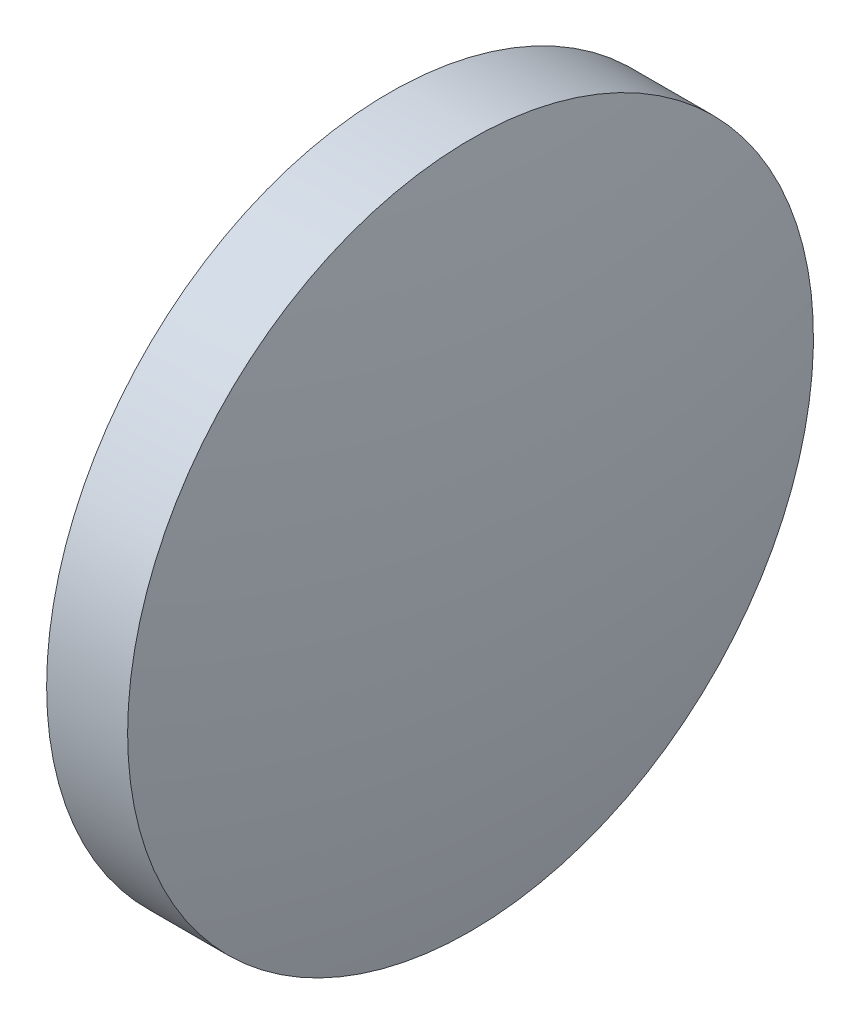
ISO-10303-21;
HEADER;
FILE_DESCRIPTION(('STEP AP214'),'2;1');
FILE_NAME('part.step','',(''),(''),'','','');
FILE_SCHEMA(('AUTOMOTIVE_DESIGN { 1 0 10303 214 1 1 1 1 }'));
ENDSEC;
DATA;
#1=APPLICATION_CONTEXT('core data for automotive mechanical design processes');
#2=APPLICATION_PROTOCOL_DEFINITION('international standard','automotive_design',2000,#1);
#3=PRODUCT_CONTEXT('',#1,'mechanical');
#4=PRODUCT('Part','Part','',(#3));
#5=PRODUCT_RELATED_PRODUCT_CATEGORY('part','',(#4));
#6=PRODUCT_DEFINITION_FORMATION('','',#4);
#7=PRODUCT_DEFINITION_CONTEXT('part definition',#1,'design');
#8=PRODUCT_DEFINITION('design','',#6,#7);
#9=PRODUCT_DEFINITION_SHAPE('','',#8);
#10=(LENGTH_UNIT() NAMED_UNIT(*) SI_UNIT(.MILLI.,.METRE.));
#11=(NAMED_UNIT(*) PLANE_ANGLE_UNIT() SI_UNIT($,.RADIAN.));
#12=(NAMED_UNIT(*) SI_UNIT($,.STERADIAN.) SOLID_ANGLE_UNIT());
#13=UNCERTAINTY_MEASURE_WITH_UNIT(LENGTH_MEASURE(1.E-05),#10,'distance_accuracy_value','');
#14=(GEOMETRIC_REPRESENTATION_CONTEXT(3) GLOBAL_UNCERTAINTY_ASSIGNED_CONTEXT((#13)) GLOBAL_UNIT_ASSIGNED_CONTEXT((#10,
#11,#12)) REPRESENTATION_CONTEXT('',''));
#15=CARTESIAN_POINT('',(0.,0.,0.));
#16=DIRECTION('',(0.,0.,1.));
#17=DIRECTION('',(1.,0.,0.));
#18=AXIS2_PLACEMENT_3D('',#15,#16,#17);
#19=CARTESIAN_POINT('',(51.1046064308381,65.2335549264122,0.));
#20=DIRECTION('',(-1.,0.,0.));
#21=DIRECTION('',(0.,-1.,0.));
#22=AXIS2_PLACEMENT_3D('',#19,#20,#21);
#23=SPHERICAL_SURFACE('',#22,68.85);
#24=CARTESIAN_POINT('',(118.773155255237,65.2335549264122,0.));
#25=DIRECTION('',(-1.,0.,0.));
#26=DIRECTION('',(0.,0.,1.));
#27=AXIS2_PLACEMENT_3D('',#24,#25,#26);
#28=CIRCLE('',#27,12.7);
#29=CARTESIAN_POINT('',(118.773155255237,65.2335549264122,12.7));
#30=VERTEX_POINT('',#29);
#31=EDGE_CURVE('E10',#30,#30,#28,.T.);
#32=ORIENTED_EDGE('',*,*,#31,.F.);
#33=EDGE_LOOP('',(#32));
#34=FACE_BOUND('',#33,.T.);
#35=ADVANCED_FACE('F35',(#34),#23,.T.);
#36=CARTESIAN_POINT('',(110.165373228488,65.2335549264122,0.));
#37=DIRECTION('',(-1.,0.,0.));
#38=DIRECTION('',(0.,0.,1.));
#39=AXIS2_PLACEMENT_3D('',#36,#37,#38);
#40=CYLINDRICAL_SURFACE('',#39,12.7);
#41=CARTESIAN_POINT('',(115.773606430838,65.2335549264122,0.));
#42=DIRECTION('',(-1.,0.,0.));
#43=DIRECTION('',(0.,0.,1.));
#44=AXIS2_PLACEMENT_3D('',#41,#42,#43);
#45=CIRCLE('',#44,12.7);
#46=CARTESIAN_POINT('',(115.773606430838,65.2335549264122,12.7));
#47=VERTEX_POINT('',#46);
#48=EDGE_CURVE('E41',#47,#47,#45,.T.);
#49=ORIENTED_EDGE('',*,*,#48,.F.);
#50=EDGE_LOOP('',(#49));
#51=FACE_BOUND('',#50,.T.);
#52=ORIENTED_EDGE('',*,*,#31,.T.);
#53=EDGE_LOOP('',(#52));
#54=FACE_BOUND('',#53,.T.);
#55=ADVANCED_FACE('F49',(#51,#54),#40,.T.);
#56=CARTESIAN_POINT('',(115.773606430838,65.2335549264122,0.));
#57=DIRECTION('',(1.,0.,0.));
#58=DIRECTION('',(0.,0.,-1.));
#59=AXIS2_PLACEMENT_3D('',#56,#57,#58);
#60=PLANE('',#59);
#61=ORIENTED_EDGE('',*,*,#48,.T.);
#62=EDGE_LOOP('',(#61));
#63=FACE_BOUND('',#62,.T.);
#64=ADVANCED_FACE('F47',(#63),#60,.F.);
#65=CLOSED_SHELL('',(#35,#55,#64));
#66=MANIFOLD_SOLID_BREP('B2',#65);
#67=ADVANCED_BREP_SHAPE_REPRESENTATION('',(#18,#66),#14);
#68=SHAPE_DEFINITION_REPRESENTATION(#9,#67);
ENDSEC;
END-ISO-10303-21;
